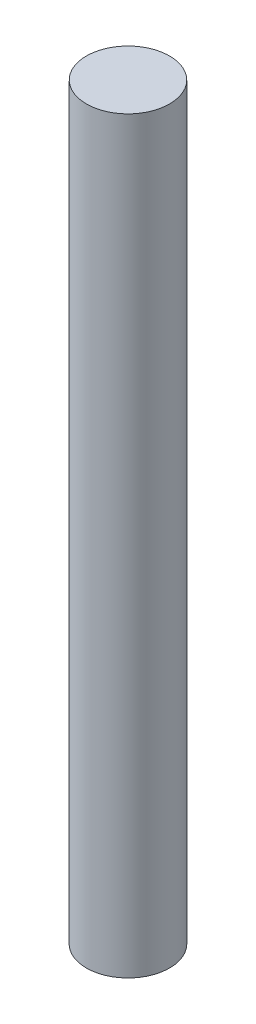
ISO-10303-21;
HEADER;
FILE_DESCRIPTION(('STEP AP214'),'2;1');
FILE_NAME('part.step','',(''),(''),'','','');
FILE_SCHEMA(('AUTOMOTIVE_DESIGN { 1 0 10303 214 1 1 1 1 }'));
ENDSEC;
DATA;
#1=APPLICATION_CONTEXT('core data for automotive mechanical design processes');
#2=APPLICATION_PROTOCOL_DEFINITION('international standard','automotive_design',2000,#1);
#3=PRODUCT_CONTEXT('',#1,'mechanical');
#4=PRODUCT('Part','Part','',(#3));
#5=PRODUCT_RELATED_PRODUCT_CATEGORY('part','',(#4));
#6=PRODUCT_DEFINITION_FORMATION('','',#4);
#7=PRODUCT_DEFINITION_CONTEXT('part definition',#1,'design');
#8=PRODUCT_DEFINITION('design','',#6,#7);
#9=PRODUCT_DEFINITION_SHAPE('','',#8);
#10=(LENGTH_UNIT() NAMED_UNIT(*) SI_UNIT(.MILLI.,.METRE.));
#11=(NAMED_UNIT(*) PLANE_ANGLE_UNIT() SI_UNIT($,.RADIAN.));
#12=(NAMED_UNIT(*) SI_UNIT($,.STERADIAN.) SOLID_ANGLE_UNIT());
#13=UNCERTAINTY_MEASURE_WITH_UNIT(LENGTH_MEASURE(1.E-05),#10,'distance_accuracy_value','');
#14=(GEOMETRIC_REPRESENTATION_CONTEXT(3) GLOBAL_UNCERTAINTY_ASSIGNED_CONTEXT((#13)) GLOBAL_UNIT_ASSIGNED_CONTEXT((#10,
#11,#12)) REPRESENTATION_CONTEXT('',''));
#15=CARTESIAN_POINT('',(0.,0.,0.));
#16=DIRECTION('',(0.,0.,1.));
#17=DIRECTION('',(1.,0.,0.));
#18=AXIS2_PLACEMENT_3D('',#15,#16,#17);
#19=CARTESIAN_POINT('',(0.,28.575,0.));
#20=DIRECTION('',(0.,-1.,0.));
#21=DIRECTION('',(0.,0.,-1.));
#22=AXIS2_PLACEMENT_3D('',#19,#20,#21);
#23=CYLINDRICAL_SURFACE('',#22,1.5875);
#24=CARTESIAN_POINT('',(0.,28.575,0.));
#25=DIRECTION('',(0.,1.,0.));
#26=DIRECTION('',(0.,0.,1.));
#27=AXIS2_PLACEMENT_3D('',#24,#25,#26);
#28=CIRCLE('',#27,1.5875);
#29=CARTESIAN_POINT('',(0.,28.575,1.5875));
#30=VERTEX_POINT('',#29);
#31=EDGE_CURVE('E10',#30,#30,#28,.T.);
#32=ORIENTED_EDGE('',*,*,#31,.F.);
#33=EDGE_LOOP('',(#32));
#34=FACE_BOUND('',#33,.T.);
#35=CARTESIAN_POINT('',(0.,0.,0.));
#36=DIRECTION('',(0.,1.,0.));
#37=DIRECTION('',(0.,0.,1.));
#38=AXIS2_PLACEMENT_3D('',#35,#36,#37);
#39=CIRCLE('',#38,1.5875);
#40=CARTESIAN_POINT('',(0.,0.,1.5875));
#41=VERTEX_POINT('',#40);
#42=EDGE_CURVE('E42',#41,#41,#39,.T.);
#43=ORIENTED_EDGE('',*,*,#42,.T.);
#44=EDGE_LOOP('',(#43));
#45=FACE_BOUND('',#44,.T.);
#46=ADVANCED_FACE('F39',(#34,#45),#23,.T.);
#47=CARTESIAN_POINT('',(0.,28.575,0.));
#48=DIRECTION('',(0.,1.,0.));
#49=DIRECTION('',(0.,0.,1.));
#50=AXIS2_PLACEMENT_3D('',#47,#48,#49);
#51=PLANE('',#50);
#52=ORIENTED_EDGE('',*,*,#31,.T.);
#53=EDGE_LOOP('',(#52));
#54=FACE_BOUND('',#53,.T.);
#55=ADVANCED_FACE('F56',(#54),#51,.T.);
#56=CARTESIAN_POINT('',(0.,0.,0.));
#57=DIRECTION('',(0.,1.,0.));
#58=DIRECTION('',(0.,0.,1.));
#59=AXIS2_PLACEMENT_3D('',#56,#57,#58);
#60=PLANE('',#59);
#61=ORIENTED_EDGE('',*,*,#42,.F.);
#62=EDGE_LOOP('',(#61));
#63=FACE_BOUND('',#62,.T.);
#64=ADVANCED_FACE('F54',(#63),#60,.F.);
#65=CLOSED_SHELL('',(#46,#55,#64));
#66=MANIFOLD_SOLID_BREP('B2',#65);
#67=ADVANCED_BREP_SHAPE_REPRESENTATION('',(#18,#66),#14);
#68=SHAPE_DEFINITION_REPRESENTATION(#9,#67);
ENDSEC;
END-ISO-10303-21;
